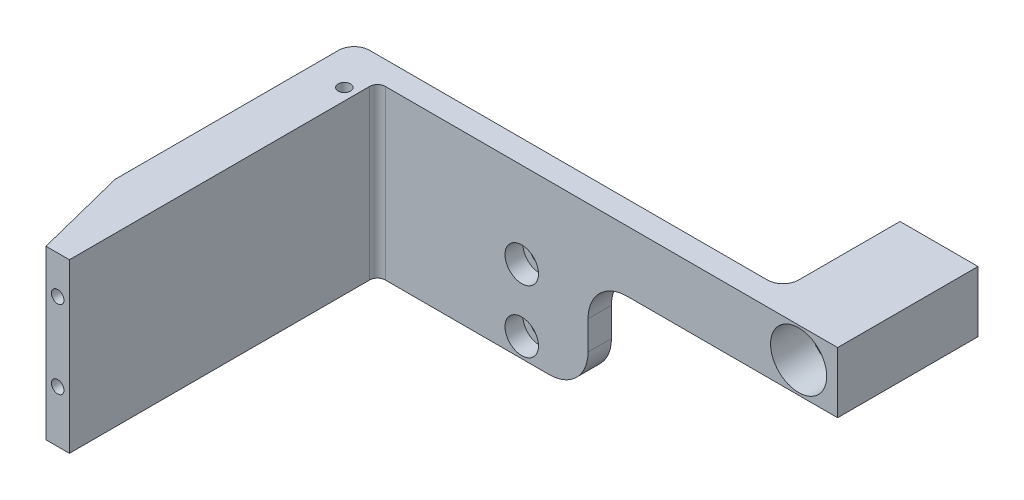
ISO-10303-21;
HEADER;
FILE_DESCRIPTION(('STEP AP214'),'2;1');
FILE_NAME('part.step','',(''),(''),'','','');
FILE_SCHEMA(('AUTOMOTIVE_DESIGN { 1 0 10303 214 1 1 1 1 }'));
ENDSEC;
DATA;
#1=APPLICATION_CONTEXT('core data for automotive mechanical design processes');
#2=APPLICATION_PROTOCOL_DEFINITION('international standard','automotive_design',2000,#1);
#3=PRODUCT_CONTEXT('',#1,'mechanical');
#4=PRODUCT('Part','Part','',(#3));
#5=PRODUCT_RELATED_PRODUCT_CATEGORY('part','',(#4));
#6=PRODUCT_DEFINITION_FORMATION('','',#4);
#7=PRODUCT_DEFINITION_CONTEXT('part definition',#1,'design');
#8=PRODUCT_DEFINITION('design','',#6,#7);
#9=PRODUCT_DEFINITION_SHAPE('','',#8);
#10=(LENGTH_UNIT() NAMED_UNIT(*) SI_UNIT(.MILLI.,.METRE.));
#11=(NAMED_UNIT(*) PLANE_ANGLE_UNIT() SI_UNIT($,.RADIAN.));
#12=(NAMED_UNIT(*) SI_UNIT($,.STERADIAN.) SOLID_ANGLE_UNIT());
#13=UNCERTAINTY_MEASURE_WITH_UNIT(LENGTH_MEASURE(1.E-05),#10,'distance_accuracy_value','');
#14=(GEOMETRIC_REPRESENTATION_CONTEXT(3) GLOBAL_UNCERTAINTY_ASSIGNED_CONTEXT((#13)) GLOBAL_UNIT_ASSIGNED_CONTEXT((#10,
#11,#12)) REPRESENTATION_CONTEXT('',''));
#15=CARTESIAN_POINT('',(0.,0.,0.));
#16=DIRECTION('',(0.,0.,1.));
#17=DIRECTION('',(1.,0.,0.));
#18=AXIS2_PLACEMENT_3D('',#15,#16,#17);
#19=CARTESIAN_POINT('',(0.,0.,3.));
#20=DIRECTION('',(0.,0.,1.));
#21=DIRECTION('',(1.,0.,0.));
#22=AXIS2_PLACEMENT_3D('',#19,#20,#21);
#23=PLANE('',#22);
#24=DIRECTION('',(-1.,0.,0.));
#25=VECTOR('',#24,1.);
#26=CARTESIAN_POINT('',(0.,-6.5,3.));
#27=LINE('',#26,#25);
#28=CARTESIAN_POINT('',(15.,-6.5,3.));
#29=VERTEX_POINT('',#28);
#30=CARTESIAN_POINT('',(-5.99999999999999,-6.50000000000001,3.));
#31=VERTEX_POINT('',#30);
#32=EDGE_CURVE('E297',#29,#31,#27,.T.);
#33=ORIENTED_EDGE('',*,*,#32,.F.);
#34=CARTESIAN_POINT('',(15.,-1.5,3.));
#35=DIRECTION('',(0.,0.,1.));
#36=DIRECTION('',(1.,0.,0.));
#37=AXIS2_PLACEMENT_3D('',#34,#35,#36);
#38=CIRCLE('',#37,5.);
#39=CARTESIAN_POINT('',(20.,-1.5,3.));
#40=VERTEX_POINT('',#39);
#41=EDGE_CURVE('E409',#29,#40,#38,.T.);
#42=ORIENTED_EDGE('',*,*,#41,.T.);
#43=DIRECTION('',(0.,1.,0.));
#44=VECTOR('',#43,1.);
#45=CARTESIAN_POINT('',(20.,-5.,3.));
#46=LINE('',#45,#44);
#47=CARTESIAN_POINT('',(20.,2.2,3.));
#48=VERTEX_POINT('',#47);
#49=EDGE_CURVE('E348',#40,#48,#46,.T.);
#50=ORIENTED_EDGE('',*,*,#49,.T.);
#51=CARTESIAN_POINT('',(25.,2.2,3.));
#52=DIRECTION('',(0.,0.,1.));
#53=DIRECTION('',(1.,0.,0.));
#54=AXIS2_PLACEMENT_3D('',#51,#52,#53);
#55=CIRCLE('',#54,5.);
#56=CARTESIAN_POINT('',(25.,7.2,3.));
#57=VERTEX_POINT('',#56);
#58=EDGE_CURVE('E11',#48,#57,#55,.F.);
#59=ORIENTED_EDGE('',*,*,#58,.T.);
#60=DIRECTION('',(-1.,0.,0.));
#61=VECTOR('',#60,1.);
#62=CARTESIAN_POINT('',(52.,7.2,3.));
#63=LINE('',#62,#61);
#64=CARTESIAN_POINT('',(52.,7.2,3.));
#65=VERTEX_POINT('',#64);
#66=EDGE_CURVE('E284',#65,#57,#63,.T.);
#67=ORIENTED_EDGE('',*,*,#66,.F.);
#68=DIRECTION('',(0.,-1.,0.));
#69=VECTOR('',#68,1.);
#70=CARTESIAN_POINT('',(52.,15.,3.));
#71=LINE('',#70,#69);
#72=CARTESIAN_POINT('',(52.,15.,3.));
#73=VERTEX_POINT('',#72);
#74=EDGE_CURVE('E274',#73,#65,#71,.T.);
#75=ORIENTED_EDGE('',*,*,#74,.F.);
#76=DIRECTION('',(1.,0.,0.));
#77=VECTOR('',#76,1.);
#78=CARTESIAN_POINT('',(20.,15.,3.));
#79=LINE('',#78,#77);
#80=CARTESIAN_POINT('',(-5.99999999999999,15.,3.));
#81=VERTEX_POINT('',#80);
#82=EDGE_CURVE('E338',#81,#73,#79,.T.);
#83=ORIENTED_EDGE('',*,*,#82,.F.);
#84=DIRECTION('',(0.,1.,0.));
#85=VECTOR('',#84,1.);
#86=CARTESIAN_POINT('',(-6.,0.,3.));
#87=LINE('',#86,#85);
#88=EDGE_CURVE('E357',#81,#31,#87,.F.);
#89=ORIENTED_EDGE('',*,*,#88,.T.);
#90=EDGE_LOOP('',(#33,#42,#50,#59,#67,#75,#83,#89));
#91=FACE_BOUND('',#90,.T.);
#92=CARTESIAN_POINT('',(47.,11.1,3.));
#93=DIRECTION('',(0.,0.,1.));
#94=DIRECTION('',(1.,0.,0.));
#95=AXIS2_PLACEMENT_3D('',#92,#93,#94);
#96=CIRCLE('',#95,3.6);
#97=CARTESIAN_POINT('',(50.6,11.1,3.));
#98=VERTEX_POINT('',#97);
#99=EDGE_CURVE('E240',#98,#98,#96,.T.);
#100=ORIENTED_EDGE('',*,*,#99,.F.);
#101=EDGE_LOOP('',(#100));
#102=FACE_BOUND('',#101,.T.);
#103=CARTESIAN_POINT('',(11.5,4.,3.));
#104=DIRECTION('',(0.,0.,1.));
#105=DIRECTION('',(1.,0.,0.));
#106=AXIS2_PLACEMENT_3D('',#103,#104,#105);
#107=CIRCLE('',#106,2.15);
#108=CARTESIAN_POINT('',(13.65,4.,3.));
#109=VERTEX_POINT('',#108);
#110=EDGE_CURVE('E308',#109,#109,#107,.T.);
#111=ORIENTED_EDGE('',*,*,#110,.F.);
#112=EDGE_LOOP('',(#111));
#113=FACE_BOUND('',#112,.T.);
#114=CARTESIAN_POINT('',(11.5,-4.,3.));
#115=DIRECTION('',(0.,0.,1.));
#116=DIRECTION('',(1.,0.,0.));
#117=AXIS2_PLACEMENT_3D('',#114,#115,#116);
#118=CIRCLE('',#117,2.15);
#119=CARTESIAN_POINT('',(13.65,-4.,3.));
#120=VERTEX_POINT('',#119);
#121=EDGE_CURVE('E321',#120,#120,#118,.T.);
#122=ORIENTED_EDGE('',*,*,#121,.F.);
#123=EDGE_LOOP('',(#122));
#124=FACE_BOUND('',#123,.T.);
#125=ADVANCED_FACE('F42',(#91,#102,#113,#124),#23,.T.);
#126=CARTESIAN_POINT('',(0.,0.,0.));
#127=DIRECTION('',(0.,0.,1.));
#128=DIRECTION('',(1.,0.,0.));
#129=AXIS2_PLACEMENT_3D('',#126,#127,#128);
#130=PLANE('',#129);
#131=CARTESIAN_POINT('',(11.5,-4.,0.));
#132=DIRECTION('',(0.,0.,1.));
#133=DIRECTION('',(1.,0.,0.));
#134=AXIS2_PLACEMENT_3D('',#131,#132,#133);
#135=CIRCLE('',#134,1.2);
#136=CARTESIAN_POINT('',(12.7,-4.,0.));
#137=VERTEX_POINT('',#136);
#138=EDGE_CURVE('E333',#137,#137,#135,.T.);
#139=ORIENTED_EDGE('',*,*,#138,.T.);
#140=EDGE_LOOP('',(#139));
#141=FACE_BOUND('',#140,.T.);
#142=CARTESIAN_POINT('',(11.5,4.,0.));
#143=DIRECTION('',(0.,0.,1.));
#144=DIRECTION('',(1.,0.,0.));
#145=AXIS2_PLACEMENT_3D('',#142,#143,#144);
#146=CIRCLE('',#145,1.2);
#147=CARTESIAN_POINT('',(12.7,4.,0.));
#148=VERTEX_POINT('',#147);
#149=EDGE_CURVE('E320',#148,#148,#146,.T.);
#150=ORIENTED_EDGE('',*,*,#149,.T.);
#151=EDGE_LOOP('',(#150));
#152=FACE_BOUND('',#151,.T.);
#153=DIRECTION('',(0.,1.,0.));
#154=VECTOR('',#153,1.);
#155=CARTESIAN_POINT('',(20.,-5.,0.));
#156=LINE('',#155,#154);
#157=CARTESIAN_POINT('',(20.,-1.5,0.));
#158=VERTEX_POINT('',#157);
#159=CARTESIAN_POINT('',(20.,2.2,0.));
#160=VERTEX_POINT('',#159);
#161=EDGE_CURVE('E347',#158,#160,#156,.T.);
#162=ORIENTED_EDGE('',*,*,#161,.F.);
#163=CARTESIAN_POINT('',(15.,-1.5,0.));
#164=DIRECTION('',(0.,0.,1.));
#165=DIRECTION('',(1.,0.,0.));
#166=AXIS2_PLACEMENT_3D('',#163,#164,#165);
#167=CIRCLE('',#166,5.);
#168=CARTESIAN_POINT('',(15.,-6.5,0.));
#169=VERTEX_POINT('',#168);
#170=EDGE_CURVE('E404',#158,#169,#167,.F.);
#171=ORIENTED_EDGE('',*,*,#170,.T.);
#172=DIRECTION('',(1.,0.,0.));
#173=VECTOR('',#172,1.);
#174=CARTESIAN_POINT('',(20.,-6.5,0.));
#175=LINE('',#174,#173);
#176=CARTESIAN_POINT('',(-11.,-6.5,0.));
#177=VERTEX_POINT('',#176);
#178=EDGE_CURVE('E294',#177,#169,#175,.T.);
#179=ORIENTED_EDGE('',*,*,#178,.F.);
#180=DIRECTION('',(0.,1.,0.));
#181=VECTOR('',#180,1.);
#182=CARTESIAN_POINT('',(-11.,0.,0.));
#183=LINE('',#182,#181);
#184=CARTESIAN_POINT('',(-11.,15.,0.));
#185=VERTEX_POINT('',#184);
#186=EDGE_CURVE('E384',#177,#185,#183,.T.);
#187=ORIENTED_EDGE('',*,*,#186,.T.);
#188=DIRECTION('',(-1.,0.,0.));
#189=VECTOR('',#188,1.);
#190=CARTESIAN_POINT('',(-20.,15.,0.));
#191=LINE('',#190,#189);
#192=CARTESIAN_POINT('',(40.,15.,0.));
#193=VERTEX_POINT('',#192);
#194=EDGE_CURVE('E334',#193,#185,#191,.T.);
#195=ORIENTED_EDGE('',*,*,#194,.F.);
#196=DIRECTION('',(0.,1.,0.));
#197=VECTOR('',#196,1.);
#198=CARTESIAN_POINT('',(40.,7.2,0.));
#199=LINE('',#198,#197);
#200=CARTESIAN_POINT('',(40.,7.2,0.));
#201=VERTEX_POINT('',#200);
#202=EDGE_CURVE('E375',#193,#201,#199,.F.);
#203=ORIENTED_EDGE('',*,*,#202,.T.);
#204=DIRECTION('',(-1.,0.,0.));
#205=VECTOR('',#204,1.);
#206=CARTESIAN_POINT('',(52.,7.2,0.));
#207=LINE('',#206,#205);
#208=CARTESIAN_POINT('',(25.,7.2,0.));
#209=VERTEX_POINT('',#208);
#210=EDGE_CURVE('E280',#201,#209,#207,.T.);
#211=ORIENTED_EDGE('',*,*,#210,.T.);
#212=CARTESIAN_POINT('',(25.,2.2,0.));
#213=DIRECTION('',(0.,0.,1.));
#214=DIRECTION('',(1.,0.,0.));
#215=AXIS2_PLACEMENT_3D('',#212,#213,#214);
#216=CIRCLE('',#215,5.);
#217=EDGE_CURVE('E51',#209,#160,#216,.T.);
#218=ORIENTED_EDGE('',*,*,#217,.T.);
#219=EDGE_LOOP('',(#162,#171,#179,#187,#195,#203,#211,#218));
#220=FACE_BOUND('',#219,.T.);
#221=ADVANCED_FACE('F418',(#141,#152,#220),#130,.F.);
#222=CARTESIAN_POINT('',(20.,-5.,3.));
#223=DIRECTION('',(-1.,0.,0.));
#224=DIRECTION('',(0.,0.,1.));
#225=AXIS2_PLACEMENT_3D('',#222,#223,#224);
#226=PLANE('',#225);
#227=ORIENTED_EDGE('',*,*,#49,.F.);
#228=DIRECTION('',(0.,0.,-1.));
#229=VECTOR('',#228,1.);
#230=CARTESIAN_POINT('',(20.,-1.5,3.));
#231=LINE('',#230,#229);
#232=EDGE_CURVE('E400',#40,#158,#231,.T.);
#233=ORIENTED_EDGE('',*,*,#232,.T.);
#234=ORIENTED_EDGE('',*,*,#161,.T.);
#235=DIRECTION('',(0.,0.,-1.));
#236=VECTOR('',#235,1.);
#237=CARTESIAN_POINT('',(20.,2.2,3.));
#238=LINE('',#237,#236);
#239=EDGE_CURVE('E397',#160,#48,#238,.F.);
#240=ORIENTED_EDGE('',*,*,#239,.T.);
#241=EDGE_LOOP('',(#227,#233,#234,#240));
#242=FACE_BOUND('',#241,.T.);
#243=ADVANCED_FACE('F425',(#242),#226,.F.);
#244=CARTESIAN_POINT('',(-7.,-5.,42.5));
#245=DIRECTION('',(-1.,0.,0.));
#246=DIRECTION('',(0.,0.,1.));
#247=AXIS2_PLACEMENT_3D('',#244,#245,#246);
#248=PLANE('',#247);
#249=DIRECTION('',(0.,1.,0.));
#250=VECTOR('',#249,1.);
#251=CARTESIAN_POINT('',(-7.,-5.,42.5));
#252=LINE('',#251,#250);
#253=CARTESIAN_POINT('',(-7.,-6.50000000000001,42.5));
#254=VERTEX_POINT('',#253);
#255=CARTESIAN_POINT('',(-7.,15.,42.5));
#256=VERTEX_POINT('',#255);
#257=EDGE_CURVE('E344',#254,#256,#252,.T.);
#258=ORIENTED_EDGE('',*,*,#257,.F.);
#259=DIRECTION('',(0.,0.,-1.));
#260=VECTOR('',#259,1.);
#261=CARTESIAN_POINT('',(-7.,-6.50000000000001,4.));
#262=LINE('',#261,#260);
#263=CARTESIAN_POINT('',(-7.,-6.50000000000002,4.));
#264=VERTEX_POINT('',#263);
#265=EDGE_CURVE('E200',#254,#264,#262,.T.);
#266=ORIENTED_EDGE('',*,*,#265,.T.);
#267=DIRECTION('',(0.,1.,0.));
#268=VECTOR('',#267,1.);
#269=CARTESIAN_POINT('',(-7.,-5.,4.));
#270=LINE('',#269,#268);
#271=CARTESIAN_POINT('',(-7.,15.,4.));
#272=VERTEX_POINT('',#271);
#273=EDGE_CURVE('E351',#264,#272,#270,.T.);
#274=ORIENTED_EDGE('',*,*,#273,.T.);
#275=DIRECTION('',(0.,0.,1.));
#276=VECTOR('',#275,1.);
#277=CARTESIAN_POINT('',(-7.,15.,42.5));
#278=LINE('',#277,#276);
#279=EDGE_CURVE('E213',#272,#256,#278,.T.);
#280=ORIENTED_EDGE('',*,*,#279,.T.);
#281=EDGE_LOOP('',(#258,#266,#274,#280));
#282=FACE_BOUND('',#281,.T.);
#283=ADVANCED_FACE('F480',(#282),#248,.F.);
#284=CARTESIAN_POINT('',(0.,0.,42.5));
#285=DIRECTION('',(0.,0.,1.));
#286=DIRECTION('',(1.,0.,0.));
#287=AXIS2_PLACEMENT_3D('',#284,#285,#286);
#288=PLANE('',#287);
#289=CARTESIAN_POINT('',(-8.49999999999997,10.1457275828644,42.5));
#290=DIRECTION('',(0.,0.,1.));
#291=DIRECTION('',(1.,0.,0.));
#292=AXIS2_PLACEMENT_3D('',#289,#290,#291);
#293=CIRCLE('',#292,0.799999999999995);
#294=CARTESIAN_POINT('',(-7.69999999999997,10.1457275828644,42.5));
#295=VERTEX_POINT('',#294);
#296=EDGE_CURVE('E192',#295,#295,#293,.T.);
#297=ORIENTED_EDGE('',*,*,#296,.F.);
#298=EDGE_LOOP('',(#297));
#299=FACE_BOUND('',#298,.T.);
#300=CARTESIAN_POINT('',(-8.49999999999997,0.14572758286438,42.5));
#301=DIRECTION('',(0.,0.,1.));
#302=DIRECTION('',(1.,0.,0.));
#303=AXIS2_PLACEMENT_3D('',#300,#301,#302);
#304=CIRCLE('',#303,0.799999999999999);
#305=CARTESIAN_POINT('',(-7.69999999999997,0.14572758286438,42.5));
#306=VERTEX_POINT('',#305);
#307=EDGE_CURVE('E300',#306,#306,#304,.T.);
#308=ORIENTED_EDGE('',*,*,#307,.F.);
#309=EDGE_LOOP('',(#308));
#310=FACE_BOUND('',#309,.T.);
#311=ORIENTED_EDGE('',*,*,#257,.T.);
#312=DIRECTION('',(-1.,0.,0.));
#313=VECTOR('',#312,1.);
#314=CARTESIAN_POINT('',(-10.,15.,42.5));
#315=LINE('',#314,#313);
#316=CARTESIAN_POINT('',(-10.,15.,42.5));
#317=VERTEX_POINT('',#316);
#318=EDGE_CURVE('E217',#256,#317,#315,.T.);
#319=ORIENTED_EDGE('',*,*,#318,.T.);
#320=DIRECTION('',(0.,-1.,0.));
#321=VECTOR('',#320,1.);
#322=CARTESIAN_POINT('',(-9.99999999999999,5.,42.5));
#323=LINE('',#322,#321);
#324=CARTESIAN_POINT('',(-9.99999999999999,-6.50000000000001,42.5));
#325=VERTEX_POINT('',#324);
#326=EDGE_CURVE('E341',#317,#325,#323,.T.);
#327=ORIENTED_EDGE('',*,*,#326,.T.);
#328=DIRECTION('',(1.,0.,0.));
#329=VECTOR('',#328,1.);
#330=CARTESIAN_POINT('',(-6.99999999999999,-6.50000000000001,42.5));
#331=LINE('',#330,#329);
#332=EDGE_CURVE('E209',#325,#254,#331,.T.);
#333=ORIENTED_EDGE('',*,*,#332,.T.);
#334=EDGE_LOOP('',(#311,#319,#327,#333));
#335=FACE_BOUND('',#334,.T.);
#336=ADVANCED_FACE('F495',(#299,#310,#335),#288,.T.);
#337=CARTESIAN_POINT('',(-20.,-45.7461654637587,3.));
#338=DIRECTION('',(-0.969416374533033,0.,0.245421866970388));
#339=DIRECTION('',(0.245421866970388,0.,0.969416374533033));
#340=AXIS2_PLACEMENT_3D('',#337,#338,#339);
#341=PLANE('',#340);
#342=DIRECTION('',(0.,1.,0.));
#343=VECTOR('',#342,1.);
#344=CARTESIAN_POINT('',(-13.,-45.7461654637587,30.65));
#345=LINE('',#344,#343);
#346=CARTESIAN_POINT('',(-13.,-6.50000000000001,30.65));
#347=VERTEX_POINT('',#346);
#348=CARTESIAN_POINT('',(-13.,15.,30.65));
#349=VERTEX_POINT('',#348);
#350=EDGE_CURVE('E290',#347,#349,#345,.T.);
#351=ORIENTED_EDGE('',*,*,#350,.F.);
#352=DIRECTION('',(0.245421866970388,0.,0.969416374533033));
#353=VECTOR('',#352,1.);
#354=CARTESIAN_POINT('',(-9.99999999999999,-6.50000000000001,42.5));
#355=LINE('',#354,#353);
#356=EDGE_CURVE('E205',#347,#325,#355,.T.);
#357=ORIENTED_EDGE('',*,*,#356,.T.);
#358=ORIENTED_EDGE('',*,*,#326,.F.);
#359=DIRECTION('',(-0.245421866970388,0.,-0.969416374533033));
#360=VECTOR('',#359,1.);
#361=CARTESIAN_POINT('',(-13.,15.,30.65));
#362=LINE('',#361,#360);
#363=EDGE_CURVE('E221',#317,#349,#362,.T.);
#364=ORIENTED_EDGE('',*,*,#363,.T.);
#365=EDGE_LOOP('',(#351,#357,#358,#364));
#366=FACE_BOUND('',#365,.T.);
#367=ADVANCED_FACE('F486',(#366),#341,.T.);
#368=CARTESIAN_POINT('',(-6.,-5.,4.));
#369=DIRECTION('',(0.,1.,0.));
#370=DIRECTION('',(0.,0.,1.));
#371=AXIS2_PLACEMENT_3D('',#368,#369,#370);
#372=CYLINDRICAL_SURFACE('',#371,1.);
#373=ORIENTED_EDGE('',*,*,#273,.F.);
#374=CARTESIAN_POINT('',(-6.,-6.50000000000001,4.));
#375=DIRECTION('',(0.,1.,0.));
#376=DIRECTION('',(0.,0.,1.));
#377=AXIS2_PLACEMENT_3D('',#374,#375,#376);
#378=CIRCLE('',#377,1.);
#379=EDGE_CURVE('E201',#264,#31,#378,.F.);
#380=ORIENTED_EDGE('',*,*,#379,.T.);
#381=ORIENTED_EDGE('',*,*,#88,.F.);
#382=CARTESIAN_POINT('',(-6.,15.,4.));
#383=DIRECTION('',(0.,-1.,0.));
#384=DIRECTION('',(1.,0.,0.));
#385=AXIS2_PLACEMENT_3D('',#382,#383,#384);
#386=CIRCLE('',#385,1.);
#387=EDGE_CURVE('E225',#81,#272,#386,.F.);
#388=ORIENTED_EDGE('',*,*,#387,.T.);
#389=EDGE_LOOP('',(#373,#380,#381,#388));
#390=FACE_BOUND('',#389,.T.);
#391=ADVANCED_FACE('F484',(#390),#372,.F.);
#392=CARTESIAN_POINT('',(0.,15.,0.));
#393=DIRECTION('',(0.,-1.,0.));
#394=DIRECTION('',(1.,0.,0.));
#395=AXIS2_PLACEMENT_3D('',#392,#393,#394);
#396=PLANE('',#395);
#397=CARTESIAN_POINT('',(-8.49999999999999,15.,5.74999999999983));
#398=DIRECTION('',(0.,1.,0.));
#399=DIRECTION('',(0.,0.,1.));
#400=AXIS2_PLACEMENT_3D('',#397,#398,#399);
#401=CIRCLE('',#400,0.79999999999999);
#402=CARTESIAN_POINT('',(-8.49999999999999,15.,6.54999999999982));
#403=VERTEX_POINT('',#402);
#404=EDGE_CURVE('E178',#403,#403,#401,.T.);
#405=ORIENTED_EDGE('',*,*,#404,.F.);
#406=EDGE_LOOP('',(#405));
#407=FACE_BOUND('',#406,.T.);
#408=ORIENTED_EDGE('',*,*,#194,.T.);
#409=CARTESIAN_POINT('',(-11.,15.,2.));
#410=DIRECTION('',(0.,-1.,0.));
#411=DIRECTION('',(1.,0.,0.));
#412=AXIS2_PLACEMENT_3D('',#409,#410,#411);
#413=CIRCLE('',#412,2.);
#414=CARTESIAN_POINT('',(-13.,15.,2.));
#415=VERTEX_POINT('',#414);
#416=EDGE_CURVE('E388',#185,#415,#413,.F.);
#417=ORIENTED_EDGE('',*,*,#416,.T.);
#418=DIRECTION('',(0.,0.,1.));
#419=VECTOR('',#418,1.);
#420=CARTESIAN_POINT('',(-13.,15.,0.));
#421=LINE('',#420,#419);
#422=EDGE_CURVE('E287',#415,#349,#421,.T.);
#423=ORIENTED_EDGE('',*,*,#422,.T.);
#424=ORIENTED_EDGE('',*,*,#363,.F.);
#425=ORIENTED_EDGE('',*,*,#318,.F.);
#426=ORIENTED_EDGE('',*,*,#279,.F.);
#427=ORIENTED_EDGE('',*,*,#387,.F.);
#428=ORIENTED_EDGE('',*,*,#82,.T.);
#429=DIRECTION('',(0.,0.,1.));
#430=VECTOR('',#429,1.);
#431=CARTESIAN_POINT('',(52.,15.,0.));
#432=LINE('',#431,#430);
#433=CARTESIAN_POINT('',(52.,15.,-15.));
#434=VERTEX_POINT('',#433);
#435=EDGE_CURVE('E270',#434,#73,#432,.T.);
#436=ORIENTED_EDGE('',*,*,#435,.F.);
#437=DIRECTION('',(1.,0.,0.));
#438=VECTOR('',#437,1.);
#439=CARTESIAN_POINT('',(42.,15.,-15.));
#440=LINE('',#439,#438);
#441=CARTESIAN_POINT('',(42.,15.,-15.));
#442=VERTEX_POINT('',#441);
#443=EDGE_CURVE('E258',#442,#434,#440,.T.);
#444=ORIENTED_EDGE('',*,*,#443,.F.);
#445=DIRECTION('',(0.,0.,1.));
#446=VECTOR('',#445,1.);
#447=CARTESIAN_POINT('',(42.,15.,-15.));
#448=LINE('',#447,#446);
#449=CARTESIAN_POINT('',(42.,15.,-2.));
#450=VERTEX_POINT('',#449);
#451=EDGE_CURVE('E262',#442,#450,#448,.T.);
#452=ORIENTED_EDGE('',*,*,#451,.T.);
#453=CARTESIAN_POINT('',(40.,15.,-2.));
#454=DIRECTION('',(0.,-1.,0.));
#455=DIRECTION('',(1.,0.,0.));
#456=AXIS2_PLACEMENT_3D('',#453,#454,#455);
#457=CIRCLE('',#456,2.);
#458=EDGE_CURVE('E378',#450,#193,#457,.T.);
#459=ORIENTED_EDGE('',*,*,#458,.T.);
#460=EDGE_LOOP('',(#408,#417,#423,#424,#425,#426,#427,#428,#436,#444,#452,#459));
#461=FACE_BOUND('',#460,.T.);
#462=ADVANCED_FACE('F440',(#407,#461),#396,.F.);
#463=CARTESIAN_POINT('',(11.5,-4.,3.));
#464=DIRECTION('',(0.,0.,1.));
#465=DIRECTION('',(1.,0.,0.));
#466=AXIS2_PLACEMENT_3D('',#463,#464,#465);
#467=CYLINDRICAL_SURFACE('',#466,1.2);
#468=CARTESIAN_POINT('',(11.5,-4.,0.7));
#469=DIRECTION('',(0.,0.,1.));
#470=DIRECTION('',(1.,0.,0.));
#471=AXIS2_PLACEMENT_3D('',#468,#469,#470);
#472=CIRCLE('',#471,1.2);
#473=CARTESIAN_POINT('',(12.7,-4.,0.7));
#474=VERTEX_POINT('',#473);
#475=EDGE_CURVE('E329',#474,#474,#472,.T.);
#476=ORIENTED_EDGE('',*,*,#475,.T.);
#477=EDGE_LOOP('',(#476));
#478=FACE_BOUND('',#477,.T.);
#479=ORIENTED_EDGE('',*,*,#138,.F.);
#480=EDGE_LOOP('',(#479));
#481=FACE_BOUND('',#480,.T.);
#482=ADVANCED_FACE('F492',(#478,#481),#467,.F.);
#483=CARTESIAN_POINT('',(12.7,-4.,0.7));
#484=DIRECTION('',(0.,0.,-1.));
#485=DIRECTION('',(-1.,0.,0.));
#486=AXIS2_PLACEMENT_3D('',#483,#484,#485);
#487=PLANE('',#486);
#488=ORIENTED_EDGE('',*,*,#475,.F.);
#489=EDGE_LOOP('',(#488));
#490=FACE_BOUND('',#489,.T.);
#491=CARTESIAN_POINT('',(11.5,-4.,0.7));
#492=DIRECTION('',(0.,0.,1.));
#493=DIRECTION('',(1.,0.,0.));
#494=AXIS2_PLACEMENT_3D('',#491,#492,#493);
#495=CIRCLE('',#494,2.15);
#496=CARTESIAN_POINT('',(13.65,-4.,0.7));
#497=VERTEX_POINT('',#496);
#498=EDGE_CURVE('E325',#497,#497,#495,.T.);
#499=ORIENTED_EDGE('',*,*,#498,.T.);
#500=EDGE_LOOP('',(#499));
#501=FACE_BOUND('',#500,.T.);
#502=ADVANCED_FACE('F550',(#490,#501),#487,.F.);
#503=CARTESIAN_POINT('',(11.5,-4.,3.));
#504=DIRECTION('',(0.,0.,1.));
#505=DIRECTION('',(1.,0.,0.));
#506=AXIS2_PLACEMENT_3D('',#503,#504,#505);
#507=CYLINDRICAL_SURFACE('',#506,2.15);
#508=ORIENTED_EDGE('',*,*,#498,.F.);
#509=EDGE_LOOP('',(#508));
#510=FACE_BOUND('',#509,.T.);
#511=ORIENTED_EDGE('',*,*,#121,.T.);
#512=EDGE_LOOP('',(#511));
#513=FACE_BOUND('',#512,.T.);
#514=ADVANCED_FACE('F546',(#510,#513),#507,.F.);
#515=CARTESIAN_POINT('',(11.5,4.,3.));
#516=DIRECTION('',(0.,0.,1.));
#517=DIRECTION('',(1.,0.,0.));
#518=AXIS2_PLACEMENT_3D('',#515,#516,#517);
#519=CYLINDRICAL_SURFACE('',#518,1.2);
#520=CARTESIAN_POINT('',(11.5,4.,0.7));
#521=DIRECTION('',(0.,0.,1.));
#522=DIRECTION('',(1.,0.,0.));
#523=AXIS2_PLACEMENT_3D('',#520,#521,#522);
#524=CIRCLE('',#523,1.2);
#525=CARTESIAN_POINT('',(12.7,4.,0.7));
#526=VERTEX_POINT('',#525);
#527=EDGE_CURVE('E316',#526,#526,#524,.T.);
#528=ORIENTED_EDGE('',*,*,#527,.T.);
#529=EDGE_LOOP('',(#528));
#530=FACE_BOUND('',#529,.T.);
#531=ORIENTED_EDGE('',*,*,#149,.F.);
#532=EDGE_LOOP('',(#531));
#533=FACE_BOUND('',#532,.T.);
#534=ADVANCED_FACE('F542',(#530,#533),#519,.F.);
#535=CARTESIAN_POINT('',(12.7,4.,0.7));
#536=DIRECTION('',(0.,0.,-1.));
#537=DIRECTION('',(-1.,0.,0.));
#538=AXIS2_PLACEMENT_3D('',#535,#536,#537);
#539=PLANE('',#538);
#540=ORIENTED_EDGE('',*,*,#527,.F.);
#541=EDGE_LOOP('',(#540));
#542=FACE_BOUND('',#541,.T.);
#543=CARTESIAN_POINT('',(11.5,4.,0.7));
#544=DIRECTION('',(0.,0.,1.));
#545=DIRECTION('',(1.,0.,0.));
#546=AXIS2_PLACEMENT_3D('',#543,#544,#545);
#547=CIRCLE('',#546,2.15);
#548=CARTESIAN_POINT('',(13.65,4.,0.7));
#549=VERTEX_POINT('',#548);
#550=EDGE_CURVE('E312',#549,#549,#547,.T.);
#551=ORIENTED_EDGE('',*,*,#550,.T.);
#552=EDGE_LOOP('',(#551));
#553=FACE_BOUND('',#552,.T.);
#554=ADVANCED_FACE('F538',(#542,#553),#539,.F.);
#555=CARTESIAN_POINT('',(11.5,4.,3.));
#556=DIRECTION('',(0.,0.,1.));
#557=DIRECTION('',(1.,0.,0.));
#558=AXIS2_PLACEMENT_3D('',#555,#556,#557);
#559=CYLINDRICAL_SURFACE('',#558,2.15);
#560=ORIENTED_EDGE('',*,*,#550,.F.);
#561=EDGE_LOOP('',(#560));
#562=FACE_BOUND('',#561,.T.);
#563=ORIENTED_EDGE('',*,*,#110,.T.);
#564=EDGE_LOOP('',(#563));
#565=FACE_BOUND('',#564,.T.);
#566=ADVANCED_FACE('F534',(#562,#565),#559,.F.);
#567=CARTESIAN_POINT('',(-8.49999999999997,0.14572758286438,37.3));
#568=DIRECTION('',(0.,0.,1.));
#569=DIRECTION('',(1.,0.,0.));
#570=AXIS2_PLACEMENT_3D('',#567,#568,#569);
#571=CONICAL_SURFACE('',#570,0.799999999999998,1.02974425867666);
#572=CARTESIAN_POINT('',(-8.49999999999997,0.14572758286438,36.819311504778));
#573=VERTEX_POINT('',#572);
#574=VERTEX_LOOP('',#573);
#575=FACE_BOUND('',#574,.T.);
#576=CARTESIAN_POINT('',(-8.49999999999997,0.14572758286438,37.3));
#577=DIRECTION('',(0.,0.,1.));
#578=DIRECTION('',(1.,0.,0.));
#579=AXIS2_PLACEMENT_3D('',#576,#577,#578);
#580=CIRCLE('',#579,0.799999999999998);
#581=CARTESIAN_POINT('',(-7.69999999999997,0.14572758286438,37.3));
#582=VERTEX_POINT('',#581);
#583=EDGE_CURVE('E304',#582,#582,#580,.T.);
#584=ORIENTED_EDGE('',*,*,#583,.T.);
#585=EDGE_LOOP('',(#584));
#586=FACE_BOUND('',#585,.T.);
#587=ADVANCED_FACE('F530',(#575,#586),#571,.F.);
#588=CARTESIAN_POINT('',(-8.49999999999997,0.14572758286438,42.5));
#589=DIRECTION('',(0.,0.,1.));
#590=DIRECTION('',(1.,0.,0.));
#591=AXIS2_PLACEMENT_3D('',#588,#589,#590);
#592=CYLINDRICAL_SURFACE('',#591,0.799999999999998);
#593=ORIENTED_EDGE('',*,*,#583,.F.);
#594=EDGE_LOOP('',(#593));
#595=FACE_BOUND('',#594,.T.);
#596=ORIENTED_EDGE('',*,*,#307,.T.);
#597=EDGE_LOOP('',(#596));
#598=FACE_BOUND('',#597,.T.);
#599=ADVANCED_FACE('F523',(#595,#598),#592,.F.);
#600=CARTESIAN_POINT('',(20.,-6.5,10.));
#601=DIRECTION('',(0.,1.,0.));
#602=DIRECTION('',(0.,0.,1.));
#603=AXIS2_PLACEMENT_3D('',#600,#601,#602);
#604=PLANE('',#603);
#605=CARTESIAN_POINT('',(-8.49999999999999,-6.5,5.74999999999987));
#606=DIRECTION('',(0.,-1.,0.));
#607=DIRECTION('',(0.,0.,-1.));
#608=AXIS2_PLACEMENT_3D('',#605,#606,#607);
#609=CIRCLE('',#608,0.79999999999999);
#610=CARTESIAN_POINT('',(-8.49999999999999,-6.5,4.94999999999988));
#611=VERTEX_POINT('',#610);
#612=EDGE_CURVE('E179',#611,#611,#609,.T.);
#613=ORIENTED_EDGE('',*,*,#612,.F.);
#614=EDGE_LOOP('',(#613));
#615=FACE_BOUND('',#614,.T.);
#616=ORIENTED_EDGE('',*,*,#178,.T.);
#617=DIRECTION('',(0.,0.,-1.));
#618=VECTOR('',#617,1.);
#619=CARTESIAN_POINT('',(15.,-6.5,10.));
#620=LINE('',#619,#618);
#621=EDGE_CURVE('E64',#169,#29,#620,.F.);
#622=ORIENTED_EDGE('',*,*,#621,.T.);
#623=ORIENTED_EDGE('',*,*,#32,.T.);
#624=ORIENTED_EDGE('',*,*,#379,.F.);
#625=ORIENTED_EDGE('',*,*,#265,.F.);
#626=ORIENTED_EDGE('',*,*,#332,.F.);
#627=ORIENTED_EDGE('',*,*,#356,.F.);
#628=DIRECTION('',(0.,0.,-1.));
#629=VECTOR('',#628,1.);
#630=CARTESIAN_POINT('',(-13.,-6.5,10.));
#631=LINE('',#630,#629);
#632=CARTESIAN_POINT('',(-13.,-6.5,2.));
#633=VERTEX_POINT('',#632);
#634=EDGE_CURVE('E361',#347,#633,#631,.T.);
#635=ORIENTED_EDGE('',*,*,#634,.T.);
#636=CARTESIAN_POINT('',(-11.,-6.5,2.));
#637=DIRECTION('',(0.,1.,0.));
#638=DIRECTION('',(0.,0.,1.));
#639=AXIS2_PLACEMENT_3D('',#636,#637,#638);
#640=CIRCLE('',#639,2.);
#641=EDGE_CURVE('E394',#633,#177,#640,.F.);
#642=ORIENTED_EDGE('',*,*,#641,.T.);
#643=EDGE_LOOP('',(#616,#622,#623,#624,#625,#626,#627,#635,#642));
#644=FACE_BOUND('',#643,.T.);
#645=ADVANCED_FACE('F502',(#615,#644),#604,.F.);
#646=CARTESIAN_POINT('',(-13.,-20.,-3.74023358772391));
#647=DIRECTION('',(1.,0.,0.));
#648=DIRECTION('',(0.,0.,-1.));
#649=AXIS2_PLACEMENT_3D('',#646,#647,#648);
#650=PLANE('',#649);
#651=ORIENTED_EDGE('',*,*,#422,.F.);
#652=DIRECTION('',(0.,1.,0.));
#653=VECTOR('',#652,1.);
#654=CARTESIAN_POINT('',(-13.,-20.,2.));
#655=LINE('',#654,#653);
#656=EDGE_CURVE('E391',#415,#633,#655,.F.);
#657=ORIENTED_EDGE('',*,*,#656,.T.);
#658=ORIENTED_EDGE('',*,*,#634,.F.);
#659=ORIENTED_EDGE('',*,*,#350,.T.);
#660=EDGE_LOOP('',(#651,#657,#658,#659));
#661=FACE_BOUND('',#660,.T.);
#662=ADVANCED_FACE('F515',(#661),#650,.F.);
#663=CARTESIAN_POINT('',(52.,7.2,3.));
#664=DIRECTION('',(0.,1.,0.));
#665=DIRECTION('',(0.,0.,1.));
#666=AXIS2_PLACEMENT_3D('',#663,#664,#665);
#667=PLANE('',#666);
#668=ORIENTED_EDGE('',*,*,#66,.T.);
#669=DIRECTION('',(0.,0.,-1.));
#670=VECTOR('',#669,1.);
#671=CARTESIAN_POINT('',(25.,7.2,0.));
#672=LINE('',#671,#670);
#673=EDGE_CURVE('E412',#57,#209,#672,.T.);
#674=ORIENTED_EDGE('',*,*,#673,.T.);
#675=ORIENTED_EDGE('',*,*,#210,.F.);
#676=CARTESIAN_POINT('',(40.,7.2,-2.));
#677=DIRECTION('',(0.,1.,0.));
#678=DIRECTION('',(0.,0.,1.));
#679=AXIS2_PLACEMENT_3D('',#676,#677,#678);
#680=CIRCLE('',#679,2.);
#681=CARTESIAN_POINT('',(42.,7.2,-2.));
#682=VERTEX_POINT('',#681);
#683=EDGE_CURVE('E381',#201,#682,#680,.T.);
#684=ORIENTED_EDGE('',*,*,#683,.T.);
#685=DIRECTION('',(0.,0.,1.));
#686=VECTOR('',#685,1.);
#687=CARTESIAN_POINT('',(42.,7.2,-15.));
#688=LINE('',#687,#686);
#689=CARTESIAN_POINT('',(42.,7.2,-15.));
#690=VERTEX_POINT('',#689);
#691=EDGE_CURVE('E266',#690,#682,#688,.T.);
#692=ORIENTED_EDGE('',*,*,#691,.F.);
#693=DIRECTION('',(-1.,0.,0.));
#694=VECTOR('',#693,1.);
#695=CARTESIAN_POINT('',(52.,7.2,-15.));
#696=LINE('',#695,#694);
#697=CARTESIAN_POINT('',(52.,7.2,-15.));
#698=VERTEX_POINT('',#697);
#699=EDGE_CURVE('E252',#698,#690,#696,.T.);
#700=ORIENTED_EDGE('',*,*,#699,.F.);
#701=DIRECTION('',(0.,0.,-1.));
#702=VECTOR('',#701,1.);
#703=CARTESIAN_POINT('',(52.,7.2,3.));
#704=LINE('',#703,#702);
#705=EDGE_CURVE('E277',#65,#698,#704,.T.);
#706=ORIENTED_EDGE('',*,*,#705,.F.);
#707=EDGE_LOOP('',(#668,#674,#675,#684,#692,#700,#706));
#708=FACE_BOUND('',#707,.T.);
#709=ADVANCED_FACE('F428',(#708),#667,.F.);
#710=CARTESIAN_POINT('',(52.,0.,0.));
#711=DIRECTION('',(1.,0.,0.));
#712=DIRECTION('',(0.,0.,-1.));
#713=AXIS2_PLACEMENT_3D('',#710,#711,#712);
#714=PLANE('',#713);
#715=ORIENTED_EDGE('',*,*,#705,.T.);
#716=DIRECTION('',(0.,-1.,0.));
#717=VECTOR('',#716,1.);
#718=CARTESIAN_POINT('',(52.,15.,-15.));
#719=LINE('',#718,#717);
#720=EDGE_CURVE('E245',#434,#698,#719,.T.);
#721=ORIENTED_EDGE('',*,*,#720,.F.);
#722=ORIENTED_EDGE('',*,*,#435,.T.);
#723=ORIENTED_EDGE('',*,*,#74,.T.);
#724=EDGE_LOOP('',(#715,#721,#722,#723));
#725=FACE_BOUND('',#724,.T.);
#726=ADVANCED_FACE('F436',(#725),#714,.T.);
#727=CARTESIAN_POINT('',(42.,7.2,-15.));
#728=DIRECTION('',(1.,0.,0.));
#729=DIRECTION('',(0.,0.,-1.));
#730=AXIS2_PLACEMENT_3D('',#727,#728,#729);
#731=PLANE('',#730);
#732=ORIENTED_EDGE('',*,*,#691,.T.);
#733=DIRECTION('',(0.,1.,0.));
#734=VECTOR('',#733,1.);
#735=CARTESIAN_POINT('',(42.,15.,-2.));
#736=LINE('',#735,#734);
#737=EDGE_CURVE('E371',#682,#450,#736,.T.);
#738=ORIENTED_EDGE('',*,*,#737,.T.);
#739=ORIENTED_EDGE('',*,*,#451,.F.);
#740=DIRECTION('',(0.,1.,0.));
#741=VECTOR('',#740,1.);
#742=CARTESIAN_POINT('',(42.,7.2,-15.));
#743=LINE('',#742,#741);
#744=EDGE_CURVE('E255',#690,#442,#743,.T.);
#745=ORIENTED_EDGE('',*,*,#744,.F.);
#746=EDGE_LOOP('',(#732,#738,#739,#745));
#747=FACE_BOUND('',#746,.T.);
#748=ADVANCED_FACE('F448',(#747),#731,.F.);
#749=CARTESIAN_POINT('',(0.,0.,-15.));
#750=DIRECTION('',(0.,0.,-1.));
#751=DIRECTION('',(-1.,0.,0.));
#752=AXIS2_PLACEMENT_3D('',#749,#750,#751);
#753=PLANE('',#752);
#754=CARTESIAN_POINT('',(47.,11.1,-15.));
#755=DIRECTION('',(0.,0.,1.));
#756=DIRECTION('',(1.,0.,0.));
#757=AXIS2_PLACEMENT_3D('',#754,#755,#756);
#758=CIRCLE('',#757,1.65);
#759=CARTESIAN_POINT('',(48.65,11.1,-15.));
#760=VERTEX_POINT('',#759);
#761=EDGE_CURVE('E236',#760,#760,#758,.T.);
#762=ORIENTED_EDGE('',*,*,#761,.T.);
#763=EDGE_LOOP('',(#762));
#764=FACE_BOUND('',#763,.T.);
#765=ORIENTED_EDGE('',*,*,#720,.T.);
#766=ORIENTED_EDGE('',*,*,#699,.T.);
#767=ORIENTED_EDGE('',*,*,#744,.T.);
#768=ORIENTED_EDGE('',*,*,#443,.T.);
#769=EDGE_LOOP('',(#765,#766,#767,#768));
#770=FACE_BOUND('',#769,.T.);
#771=ADVANCED_FACE('F443',(#764,#770),#753,.T.);
#772=CARTESIAN_POINT('',(47.,11.1,-2.));
#773=DIRECTION('',(0.,0.,1.));
#774=DIRECTION('',(1.,0.,0.));
#775=AXIS2_PLACEMENT_3D('',#772,#773,#774);
#776=CYLINDRICAL_SURFACE('',#775,3.6);
#777=CARTESIAN_POINT('',(47.,11.1,-2.));
#778=DIRECTION('',(0.,0.,1.));
#779=DIRECTION('',(1.,0.,0.));
#780=AXIS2_PLACEMENT_3D('',#777,#778,#779);
#781=CIRCLE('',#780,3.6);
#782=CARTESIAN_POINT('',(50.6,11.1,-2.));
#783=VERTEX_POINT('',#782);
#784=EDGE_CURVE('E241',#783,#783,#781,.T.);
#785=ORIENTED_EDGE('',*,*,#784,.F.);
#786=EDGE_LOOP('',(#785));
#787=FACE_BOUND('',#786,.T.);
#788=ORIENTED_EDGE('',*,*,#99,.T.);
#789=EDGE_LOOP('',(#788));
#790=FACE_BOUND('',#789,.T.);
#791=ADVANCED_FACE('F581',(#787,#790),#776,.F.);
#792=CARTESIAN_POINT('',(47.,11.1,-2.));
#793=DIRECTION('',(0.,0.,1.));
#794=DIRECTION('',(1.,0.,0.));
#795=AXIS2_PLACEMENT_3D('',#792,#793,#794);
#796=PLANE('',#795);
#797=CARTESIAN_POINT('',(47.,11.1,-2.));
#798=DIRECTION('',(0.,0.,1.));
#799=DIRECTION('',(1.,0.,0.));
#800=AXIS2_PLACEMENT_3D('',#797,#798,#799);
#801=CIRCLE('',#800,1.64999999999999);
#802=CARTESIAN_POINT('',(48.65,11.1,-2.));
#803=VERTEX_POINT('',#802);
#804=EDGE_CURVE('E229',#803,#803,#801,.T.);
#805=ORIENTED_EDGE('',*,*,#804,.F.);
#806=EDGE_LOOP('',(#805));
#807=FACE_BOUND('',#806,.T.);
#808=ORIENTED_EDGE('',*,*,#784,.T.);
#809=EDGE_LOOP('',(#808));
#810=FACE_BOUND('',#809,.T.);
#811=ADVANCED_FACE('F467',(#807,#810),#796,.T.);
#812=CARTESIAN_POINT('',(47.,11.1,-2.));
#813=DIRECTION('',(0.,0.,1.));
#814=DIRECTION('',(1.,0.,0.));
#815=AXIS2_PLACEMENT_3D('',#812,#813,#814);
#816=CYLINDRICAL_SURFACE('',#815,1.65);
#817=ORIENTED_EDGE('',*,*,#761,.F.);
#818=EDGE_LOOP('',(#817));
#819=FACE_BOUND('',#818,.T.);
#820=ORIENTED_EDGE('',*,*,#804,.T.);
#821=EDGE_LOOP('',(#820));
#822=FACE_BOUND('',#821,.T.);
#823=ADVANCED_FACE('F458',(#819,#822),#816,.F.);
#824=CARTESIAN_POINT('',(40.,7.2,-2.));
#825=DIRECTION('',(0.,-1.,0.));
#826=DIRECTION('',(0.,0.,-1.));
#827=AXIS2_PLACEMENT_3D('',#824,#825,#826);
#828=CYLINDRICAL_SURFACE('',#827,2.);
#829=ORIENTED_EDGE('',*,*,#683,.F.);
#830=ORIENTED_EDGE('',*,*,#202,.F.);
#831=ORIENTED_EDGE('',*,*,#458,.F.);
#832=ORIENTED_EDGE('',*,*,#737,.F.);
#833=EDGE_LOOP('',(#829,#830,#831,#832));
#834=FACE_BOUND('',#833,.T.);
#835=ADVANCED_FACE('F455',(#834),#828,.F.);
#836=CARTESIAN_POINT('',(-8.49999999999997,10.1457275828644,37.3));
#837=DIRECTION('',(0.,0.,1.));
#838=DIRECTION('',(1.,0.,0.));
#839=AXIS2_PLACEMENT_3D('',#836,#837,#838);
#840=CONICAL_SURFACE('',#839,0.799999999999995,1.02974425867665);
#841=CARTESIAN_POINT('',(-8.49999999999997,10.1457275828644,36.819311504778));
#842=VERTEX_POINT('',#841);
#843=VERTEX_LOOP('',#842);
#844=FACE_BOUND('',#843,.T.);
#845=CARTESIAN_POINT('',(-8.49999999999997,10.1457275828644,37.3));
#846=DIRECTION('',(0.,0.,1.));
#847=DIRECTION('',(1.,0.,0.));
#848=AXIS2_PLACEMENT_3D('',#845,#846,#847);
#849=CIRCLE('',#848,0.799999999999995);
#850=CARTESIAN_POINT('',(-7.69999999999997,10.1457275828644,37.3));
#851=VERTEX_POINT('',#850);
#852=EDGE_CURVE('E196',#851,#851,#849,.T.);
#853=ORIENTED_EDGE('',*,*,#852,.T.);
#854=EDGE_LOOP('',(#853));
#855=FACE_BOUND('',#854,.T.);
#856=ADVANCED_FACE('F457',(#844,#855),#840,.F.);
#857=CARTESIAN_POINT('',(-8.49999999999997,10.1457275828644,42.5));
#858=DIRECTION('',(0.,0.,1.));
#859=DIRECTION('',(1.,0.,0.));
#860=AXIS2_PLACEMENT_3D('',#857,#858,#859);
#861=CYLINDRICAL_SURFACE('',#860,0.799999999999995);
#862=ORIENTED_EDGE('',*,*,#852,.F.);
#863=EDGE_LOOP('',(#862));
#864=FACE_BOUND('',#863,.T.);
#865=ORIENTED_EDGE('',*,*,#296,.T.);
#866=EDGE_LOOP('',(#865));
#867=FACE_BOUND('',#866,.T.);
#868=ADVANCED_FACE('F464',(#864,#867),#861,.F.);
#869=CARTESIAN_POINT('',(-8.49999999999999,9.8,5.74999999999983));
#870=DIRECTION('',(0.,1.,0.));
#871=DIRECTION('',(0.,0.,1.));
#872=AXIS2_PLACEMENT_3D('',#869,#870,#871);
#873=CONICAL_SURFACE('',#872,0.799999999999988,1.02974425867664);
#874=CARTESIAN_POINT('',(-8.49999999999999,9.31931150477795,5.74999999999983));
#875=VERTEX_POINT('',#874);
#876=VERTEX_LOOP('',#875);
#877=FACE_BOUND('',#876,.T.);
#878=CARTESIAN_POINT('',(-8.49999999999999,9.8,5.74999999999983));
#879=DIRECTION('',(0.,1.,0.));
#880=DIRECTION('',(0.,0.,1.));
#881=AXIS2_PLACEMENT_3D('',#878,#879,#880);
#882=CIRCLE('',#881,0.799999999999988);
#883=CARTESIAN_POINT('',(-8.49999999999999,9.8,6.54999999999982));
#884=VERTEX_POINT('',#883);
#885=EDGE_CURVE('E184',#884,#884,#882,.T.);
#886=ORIENTED_EDGE('',*,*,#885,.T.);
#887=EDGE_LOOP('',(#886));
#888=FACE_BOUND('',#887,.T.);
#889=ADVANCED_FACE('F568',(#877,#888),#873,.F.);
#890=CARTESIAN_POINT('',(-8.49999999999999,15.,5.74999999999983));
#891=DIRECTION('',(0.,1.,0.));
#892=DIRECTION('',(0.,0.,1.));
#893=AXIS2_PLACEMENT_3D('',#890,#891,#892);
#894=CYLINDRICAL_SURFACE('',#893,0.799999999999989);
#895=ORIENTED_EDGE('',*,*,#885,.F.);
#896=EDGE_LOOP('',(#895));
#897=FACE_BOUND('',#896,.T.);
#898=ORIENTED_EDGE('',*,*,#404,.T.);
#899=EDGE_LOOP('',(#898));
#900=FACE_BOUND('',#899,.T.);
#901=ADVANCED_FACE('F171',(#897,#900),#894,.F.);
#902=CARTESIAN_POINT('',(-8.49999999999999,-1.30000000000001,5.74999999999987));
#903=DIRECTION('',(0.,-1.,0.));
#904=DIRECTION('',(0.,0.,-1.));
#905=AXIS2_PLACEMENT_3D('',#902,#903,#904);
#906=CONICAL_SURFACE('',#905,0.799999999999988,1.02974425867664);
#907=CARTESIAN_POINT('',(-8.49999999999999,-0.819311504777953,5.74999999999987));
#908=VERTEX_POINT('',#907);
#909=VERTEX_LOOP('',#908);
#910=FACE_BOUND('',#909,.T.);
#911=CARTESIAN_POINT('',(-8.49999999999999,-1.30000000000001,5.74999999999987));
#912=DIRECTION('',(0.,-1.,0.));
#913=DIRECTION('',(0.,0.,-1.));
#914=AXIS2_PLACEMENT_3D('',#911,#912,#913);
#915=CIRCLE('',#914,0.799999999999988);
#916=CARTESIAN_POINT('',(-8.49999999999999,-1.30000000000001,4.94999999999988));
#917=VERTEX_POINT('',#916);
#918=EDGE_CURVE('E175',#917,#917,#915,.T.);
#919=ORIENTED_EDGE('',*,*,#918,.T.);
#920=EDGE_LOOP('',(#919));
#921=FACE_BOUND('',#920,.T.);
#922=ADVANCED_FACE('F167',(#910,#921),#906,.F.);
#923=CARTESIAN_POINT('',(-8.49999999999999,-6.5,5.74999999999987));
#924=DIRECTION('',(0.,-1.,0.));
#925=DIRECTION('',(0.,0.,-1.));
#926=AXIS2_PLACEMENT_3D('',#923,#924,#925);
#927=CYLINDRICAL_SURFACE('',#926,0.799999999999989);
#928=ORIENTED_EDGE('',*,*,#918,.F.);
#929=EDGE_LOOP('',(#928));
#930=FACE_BOUND('',#929,.T.);
#931=ORIENTED_EDGE('',*,*,#612,.T.);
#932=EDGE_LOOP('',(#931));
#933=FACE_BOUND('',#932,.T.);
#934=ADVANCED_FACE('F170',(#930,#933),#927,.F.);
#935=CARTESIAN_POINT('',(-11.,0.,2.));
#936=DIRECTION('',(0.,1.,0.));
#937=DIRECTION('',(0.,0.,1.));
#938=AXIS2_PLACEMENT_3D('',#935,#936,#937);
#939=CYLINDRICAL_SURFACE('',#938,2.);
#940=ORIENTED_EDGE('',*,*,#641,.F.);
#941=ORIENTED_EDGE('',*,*,#656,.F.);
#942=ORIENTED_EDGE('',*,*,#416,.F.);
#943=ORIENTED_EDGE('',*,*,#186,.F.);
#944=EDGE_LOOP('',(#940,#941,#942,#943));
#945=FACE_BOUND('',#944,.T.);
#946=ADVANCED_FACE('F514',(#945),#939,.T.);
#947=CARTESIAN_POINT('',(15.,-1.5,3.));
#948=DIRECTION('',(0.,0.,-1.));
#949=DIRECTION('',(-1.,0.,0.));
#950=AXIS2_PLACEMENT_3D('',#947,#948,#949);
#951=CYLINDRICAL_SURFACE('',#950,5.);
#952=ORIENTED_EDGE('',*,*,#41,.F.);
#953=ORIENTED_EDGE('',*,*,#621,.F.);
#954=ORIENTED_EDGE('',*,*,#170,.F.);
#955=ORIENTED_EDGE('',*,*,#232,.F.);
#956=EDGE_LOOP('',(#952,#953,#954,#955));
#957=FACE_BOUND('',#956,.T.);
#958=ADVANCED_FACE('F665',(#957),#951,.T.);
#959=CARTESIAN_POINT('',(25.,2.2,3.));
#960=DIRECTION('',(0.,0.,1.));
#961=DIRECTION('',(1.,0.,0.));
#962=AXIS2_PLACEMENT_3D('',#959,#960,#961);
#963=CYLINDRICAL_SURFACE('',#962,5.);
#964=ORIENTED_EDGE('',*,*,#58,.F.);
#965=ORIENTED_EDGE('',*,*,#239,.F.);
#966=ORIENTED_EDGE('',*,*,#217,.F.);
#967=ORIENTED_EDGE('',*,*,#673,.F.);
#968=EDGE_LOOP('',(#964,#965,#966,#967));
#969=FACE_BOUND('',#968,.T.);
#970=ADVANCED_FACE('F44',(#969),#963,.F.);
#971=CLOSED_SHELL('',(#125,#221,#243,#283,#336,#367,#391,#462,#482,#502,#514,#534,#554,#566,
#587,#599,#645,#662,#709,#726,#748,#771,#791,#811,#823,#835,#856,#868,#889,#901,#922,#934,#946,
#958,#970));
#972=MANIFOLD_SOLID_BREP('B2',#971);
#973=ADVANCED_BREP_SHAPE_REPRESENTATION('',(#18,#972),#14);
#974=SHAPE_DEFINITION_REPRESENTATION(#9,#973);
ENDSEC;
END-ISO-10303-21;
